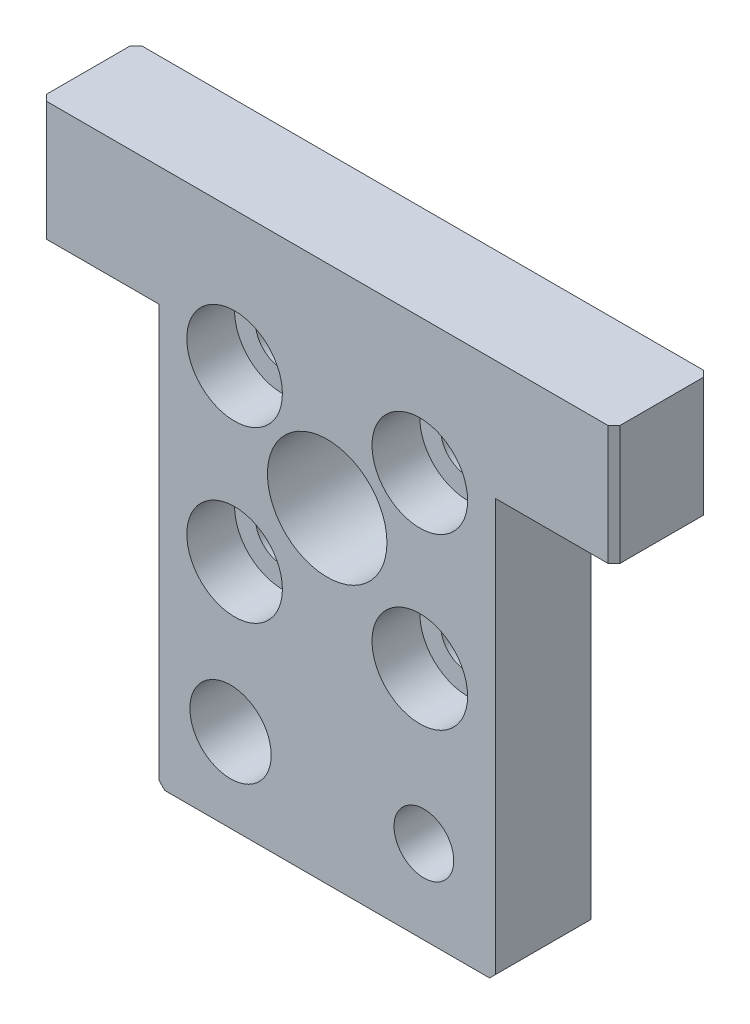
ISO-10303-21;
HEADER;
FILE_DESCRIPTION(('STEP AP214'),'2;1');
FILE_NAME('part.step','',(''),(''),'','','');
FILE_SCHEMA(('AUTOMOTIVE_DESIGN { 1 0 10303 214 1 1 1 1 }'));
ENDSEC;
DATA;
#1=APPLICATION_CONTEXT('core data for automotive mechanical design processes');
#2=APPLICATION_PROTOCOL_DEFINITION('international standard','automotive_design',2000,#1);
#3=PRODUCT_CONTEXT('',#1,'mechanical');
#4=PRODUCT('Part','Part','',(#3));
#5=PRODUCT_RELATED_PRODUCT_CATEGORY('part','',(#4));
#6=PRODUCT_DEFINITION_FORMATION('','',#4);
#7=PRODUCT_DEFINITION_CONTEXT('part definition',#1,'design');
#8=PRODUCT_DEFINITION('design','',#6,#7);
#9=PRODUCT_DEFINITION_SHAPE('','',#8);
#10=(LENGTH_UNIT() NAMED_UNIT(*) SI_UNIT(.MILLI.,.METRE.));
#11=(NAMED_UNIT(*) PLANE_ANGLE_UNIT() SI_UNIT($,.RADIAN.));
#12=(NAMED_UNIT(*) SI_UNIT($,.STERADIAN.) SOLID_ANGLE_UNIT());
#13=UNCERTAINTY_MEASURE_WITH_UNIT(LENGTH_MEASURE(1.E-05),#10,'distance_accuracy_value','');
#14=(GEOMETRIC_REPRESENTATION_CONTEXT(3) GLOBAL_UNCERTAINTY_ASSIGNED_CONTEXT((#13)) GLOBAL_UNIT_ASSIGNED_CONTEXT((#10,
#11,#12)) REPRESENTATION_CONTEXT('',''));
#15=CARTESIAN_POINT('',(0.,0.,0.));
#16=DIRECTION('',(0.,0.,1.));
#17=DIRECTION('',(1.,0.,0.));
#18=AXIS2_PLACEMENT_3D('',#15,#16,#17);
#19=CARTESIAN_POINT('',(-0.585820895522372,-3.85820895522388,8.));
#20=DIRECTION('',(0.,0.,-1.));
#21=DIRECTION('',(-1.,0.,0.));
#22=AXIS2_PLACEMENT_3D('',#19,#20,#21);
#23=CYLINDRICAL_SURFACE('',#22,2.25);
#24=CARTESIAN_POINT('',(-0.585820895522372,-3.85820895522388,0.));
#25=DIRECTION('',(0.,0.,1.));
#26=DIRECTION('',(1.,0.,0.));
#27=AXIS2_PLACEMENT_3D('',#24,#25,#26);
#28=CIRCLE('',#27,2.25);
#29=CARTESIAN_POINT('',(1.66417910447763,-3.85820895522388,0.));
#30=VERTEX_POINT('',#29);
#31=EDGE_CURVE('E452',#30,#30,#28,.T.);
#32=ORIENTED_EDGE('',*,*,#31,.F.);
#33=EDGE_LOOP('',(#32));
#34=FACE_BOUND('',#33,.T.);
#35=CARTESIAN_POINT('',(-0.585820895522372,-3.85820895522388,4.));
#36=DIRECTION('',(0.,0.,1.));
#37=DIRECTION('',(1.,0.,0.));
#38=AXIS2_PLACEMENT_3D('',#35,#36,#37);
#39=CIRCLE('',#38,2.25);
#40=CARTESIAN_POINT('',(1.66417910447763,-3.85820895522388,4.));
#41=VERTEX_POINT('',#40);
#42=EDGE_CURVE('E211',#41,#41,#39,.T.);
#43=ORIENTED_EDGE('',*,*,#42,.T.);
#44=EDGE_LOOP('',(#43));
#45=FACE_BOUND('',#44,.T.);
#46=ADVANCED_FACE('F35',(#34,#45),#23,.F.);
#47=CARTESIAN_POINT('',(14.9141791044776,-3.85820895522388,8.));
#48=DIRECTION('',(0.,0.,-1.));
#49=DIRECTION('',(-1.,0.,0.));
#50=AXIS2_PLACEMENT_3D('',#47,#48,#49);
#51=CYLINDRICAL_SURFACE('',#50,2.25);
#52=CARTESIAN_POINT('',(14.9141791044776,-3.85820895522388,0.));
#53=DIRECTION('',(0.,0.,1.));
#54=DIRECTION('',(1.,0.,0.));
#55=AXIS2_PLACEMENT_3D('',#52,#53,#54);
#56=CIRCLE('',#55,2.25);
#57=CARTESIAN_POINT('',(17.1641791044776,-3.85820895522388,0.));
#58=VERTEX_POINT('',#57);
#59=EDGE_CURVE('E449',#58,#58,#56,.T.);
#60=ORIENTED_EDGE('',*,*,#59,.F.);
#61=EDGE_LOOP('',(#60));
#62=FACE_BOUND('',#61,.T.);
#63=CARTESIAN_POINT('',(14.9141791044776,-3.85820895522388,4.));
#64=DIRECTION('',(0.,0.,1.));
#65=DIRECTION('',(1.,0.,0.));
#66=AXIS2_PLACEMENT_3D('',#63,#64,#65);
#67=CIRCLE('',#66,2.25);
#68=CARTESIAN_POINT('',(17.1641791044776,-3.85820895522388,4.));
#69=VERTEX_POINT('',#68);
#70=EDGE_CURVE('E207',#69,#69,#67,.T.);
#71=ORIENTED_EDGE('',*,*,#70,.T.);
#72=EDGE_LOOP('',(#71));
#73=FACE_BOUND('',#72,.T.);
#74=ADVANCED_FACE('F320',(#62,#73),#51,.F.);
#75=CARTESIAN_POINT('',(14.9141791044776,10.3283582089552,8.));
#76=DIRECTION('',(0.,0.,-1.));
#77=DIRECTION('',(-1.,0.,0.));
#78=AXIS2_PLACEMENT_3D('',#75,#76,#77);
#79=CYLINDRICAL_SURFACE('',#78,2.25);
#80=CARTESIAN_POINT('',(14.9141791044776,10.3283582089552,0.));
#81=DIRECTION('',(0.,0.,1.));
#82=DIRECTION('',(1.,0.,0.));
#83=AXIS2_PLACEMENT_3D('',#80,#81,#82);
#84=CIRCLE('',#83,2.25);
#85=CARTESIAN_POINT('',(17.1641791044776,10.3283582089552,0.));
#86=VERTEX_POINT('',#85);
#87=EDGE_CURVE('E417',#86,#86,#84,.T.);
#88=ORIENTED_EDGE('',*,*,#87,.F.);
#89=EDGE_LOOP('',(#88));
#90=FACE_BOUND('',#89,.T.);
#91=CARTESIAN_POINT('',(14.9141791044776,10.3283582089552,4.));
#92=DIRECTION('',(0.,0.,1.));
#93=DIRECTION('',(1.,0.,0.));
#94=AXIS2_PLACEMENT_3D('',#91,#92,#93);
#95=CIRCLE('',#94,2.25);
#96=CARTESIAN_POINT('',(17.1641791044776,10.3283582089552,4.));
#97=VERTEX_POINT('',#96);
#98=EDGE_CURVE('E204',#97,#97,#95,.T.);
#99=ORIENTED_EDGE('',*,*,#98,.T.);
#100=EDGE_LOOP('',(#99));
#101=FACE_BOUND('',#100,.T.);
#102=ADVANCED_FACE('F326',(#90,#101),#79,.F.);
#103=CARTESIAN_POINT('',(-0.585820895522371,10.3283582089552,8.));
#104=DIRECTION('',(0.,0.,-1.));
#105=DIRECTION('',(-1.,0.,0.));
#106=AXIS2_PLACEMENT_3D('',#103,#104,#105);
#107=CYLINDRICAL_SURFACE('',#106,2.25);
#108=CARTESIAN_POINT('',(-0.585820895522371,10.3283582089552,0.));
#109=DIRECTION('',(0.,0.,1.));
#110=DIRECTION('',(1.,0.,0.));
#111=AXIS2_PLACEMENT_3D('',#108,#109,#110);
#112=CIRCLE('',#111,2.25);
#113=CARTESIAN_POINT('',(1.66417910447763,10.3283582089552,0.));
#114=VERTEX_POINT('',#113);
#115=EDGE_CURVE('E202',#114,#114,#112,.T.);
#116=ORIENTED_EDGE('',*,*,#115,.F.);
#117=EDGE_LOOP('',(#116));
#118=FACE_BOUND('',#117,.T.);
#119=CARTESIAN_POINT('',(-0.585820895522371,10.3283582089552,4.));
#120=DIRECTION('',(0.,0.,1.));
#121=DIRECTION('',(1.,0.,0.));
#122=AXIS2_PLACEMENT_3D('',#119,#120,#121);
#123=CIRCLE('',#122,2.25);
#124=CARTESIAN_POINT('',(1.66417910447763,10.3283582089552,4.));
#125=VERTEX_POINT('',#124);
#126=EDGE_CURVE('E199',#125,#125,#123,.T.);
#127=ORIENTED_EDGE('',*,*,#126,.T.);
#128=EDGE_LOOP('',(#127));
#129=FACE_BOUND('',#128,.T.);
#130=ADVANCED_FACE('F340',(#118,#129),#107,.F.);
#131=CARTESIAN_POINT('',(0.,0.,8.));
#132=DIRECTION('',(0.,0.,1.));
#133=DIRECTION('',(1.,0.,0.));
#134=AXIS2_PLACEMENT_3D('',#131,#132,#133);
#135=PLANE('',#134);
#136=CARTESIAN_POINT('',(-0.925373134328333,-16.3582089552239,8.));
#137=DIRECTION('',(0.,0.,1.));
#138=DIRECTION('',(1.,0.,0.));
#139=AXIS2_PLACEMENT_3D('',#136,#137,#138);
#140=CIRCLE('',#139,3.4);
#141=CARTESIAN_POINT('',(2.47462686567166,-16.3582089552239,8.));
#142=VERTEX_POINT('',#141);
#143=EDGE_CURVE('E492',#142,#142,#140,.T.);
#144=ORIENTED_EDGE('',*,*,#143,.F.);
#145=EDGE_LOOP('',(#144));
#146=FACE_BOUND('',#145,.T.);
#147=CARTESIAN_POINT('',(15.2537313432836,-16.3582089552239,8.));
#148=DIRECTION('',(0.,0.,1.));
#149=DIRECTION('',(1.,0.,0.));
#150=AXIS2_PLACEMENT_3D('',#147,#148,#149);
#151=CIRCLE('',#150,2.5);
#152=CARTESIAN_POINT('',(17.7537313432836,-16.3582089552239,8.));
#153=VERTEX_POINT('',#152);
#154=EDGE_CURVE('E485',#153,#153,#151,.T.);
#155=ORIENTED_EDGE('',*,*,#154,.F.);
#156=EDGE_LOOP('',(#155));
#157=FACE_BOUND('',#156,.T.);
#158=CARTESIAN_POINT('',(14.9141791044776,10.3283582089552,8.));
#159=DIRECTION('',(0.,0.,1.));
#160=DIRECTION('',(1.,0.,0.));
#161=AXIS2_PLACEMENT_3D('',#158,#159,#160);
#162=CIRCLE('',#161,4.);
#163=CARTESIAN_POINT('',(18.9141791044776,10.3283582089552,8.));
#164=VERTEX_POINT('',#163);
#165=EDGE_CURVE('E422',#164,#164,#162,.T.);
#166=ORIENTED_EDGE('',*,*,#165,.F.);
#167=EDGE_LOOP('',(#166));
#168=FACE_BOUND('',#167,.T.);
#169=CARTESIAN_POINT('',(14.9141791044776,-3.85820895522388,8.));
#170=DIRECTION('',(0.,0.,1.));
#171=DIRECTION('',(1.,0.,0.));
#172=AXIS2_PLACEMENT_3D('',#169,#170,#171);
#173=CIRCLE('',#172,4.);
#174=CARTESIAN_POINT('',(18.9141791044776,-3.85820895522388,8.));
#175=VERTEX_POINT('',#174);
#176=EDGE_CURVE('E433',#175,#175,#173,.T.);
#177=ORIENTED_EDGE('',*,*,#176,.F.);
#178=EDGE_LOOP('',(#177));
#179=FACE_BOUND('',#178,.T.);
#180=CARTESIAN_POINT('',(-0.585820895522372,-3.85820895522388,8.));
#181=DIRECTION('',(0.,0.,1.));
#182=DIRECTION('',(1.,0.,0.));
#183=AXIS2_PLACEMENT_3D('',#180,#181,#182);
#184=CIRCLE('',#183,4.);
#185=CARTESIAN_POINT('',(3.41417910447763,-3.85820895522388,8.));
#186=VERTEX_POINT('',#185);
#187=EDGE_CURVE('E439',#186,#186,#184,.T.);
#188=ORIENTED_EDGE('',*,*,#187,.F.);
#189=EDGE_LOOP('',(#188));
#190=FACE_BOUND('',#189,.T.);
#191=CARTESIAN_POINT('',(-0.585820895522371,10.3283582089552,8.));
#192=DIRECTION('',(0.,0.,1.));
#193=DIRECTION('',(1.,0.,0.));
#194=AXIS2_PLACEMENT_3D('',#191,#192,#193);
#195=CIRCLE('',#194,4.);
#196=CARTESIAN_POINT('',(3.41417910447763,10.3283582089552,8.));
#197=VERTEX_POINT('',#196);
#198=EDGE_CURVE('E214',#197,#197,#195,.T.);
#199=ORIENTED_EDGE('',*,*,#198,.F.);
#200=EDGE_LOOP('',(#199));
#201=FACE_BOUND('',#200,.T.);
#202=DIRECTION('',(0.,-1.,0.));
#203=VECTOR('',#202,1.);
#204=CARTESIAN_POINT('',(-6.92537313432833,11.6417910447761,8.));
#205=LINE('',#204,#203);
#206=CARTESIAN_POINT('',(-6.92537313432833,11.6417910447761,8.));
#207=VERTEX_POINT('',#206);
#208=CARTESIAN_POINT('',(-6.92537313432833,-22.8582089552239,8.));
#209=VERTEX_POINT('',#208);
#210=EDGE_CURVE('E142',#207,#209,#205,.T.);
#211=ORIENTED_EDGE('',*,*,#210,.T.);
#212=DIRECTION('',(-0.707106781186544,0.707106781186551,0.));
#213=VECTOR('',#212,1.);
#214=CARTESIAN_POINT('',(-14.8917910447761,-14.891791044776,8.));
#215=LINE('',#214,#213);
#216=CARTESIAN_POINT('',(-6.42537313432833,-23.3582089552239,8.));
#217=VERTEX_POINT('',#216);
#218=EDGE_CURVE('E43',#209,#217,#215,.F.);
#219=ORIENTED_EDGE('',*,*,#218,.T.);
#220=DIRECTION('',(1.,0.,0.));
#221=VECTOR('',#220,1.);
#222=CARTESIAN_POINT('',(21.2537313432836,-23.3582089552239,8.));
#223=LINE('',#222,#221);
#224=CARTESIAN_POINT('',(20.7537313432836,-23.3582089552239,8.));
#225=VERTEX_POINT('',#224);
#226=EDGE_CURVE('E161',#217,#225,#223,.T.);
#227=ORIENTED_EDGE('',*,*,#226,.T.);
#228=DIRECTION('',(-0.707106781186548,-0.707106781186548,0.));
#229=VECTOR('',#228,1.);
#230=CARTESIAN_POINT('',(22.0559701492537,-22.0559701492537,8.));
#231=LINE('',#230,#229);
#232=CARTESIAN_POINT('',(21.2537313432836,-22.8582089552239,8.));
#233=VERTEX_POINT('',#232);
#234=EDGE_CURVE('E50',#225,#233,#231,.F.);
#235=ORIENTED_EDGE('',*,*,#234,.T.);
#236=DIRECTION('',(0.,1.,0.));
#237=VECTOR('',#236,1.);
#238=CARTESIAN_POINT('',(21.2537313432836,11.6417910447761,8.));
#239=LINE('',#238,#237);
#240=CARTESIAN_POINT('',(21.2537313432836,11.6417910447761,8.));
#241=VERTEX_POINT('',#240);
#242=EDGE_CURVE('E163',#233,#241,#239,.T.);
#243=ORIENTED_EDGE('',*,*,#242,.T.);
#244=DIRECTION('',(1.,0.,0.));
#245=VECTOR('',#244,1.);
#246=CARTESIAN_POINT('',(21.2537313432836,11.6417910447761,8.));
#247=LINE('',#246,#245);
#248=CARTESIAN_POINT('',(30.6641791044776,11.6417910447761,8.));
#249=VERTEX_POINT('',#248);
#250=EDGE_CURVE('E168',#241,#249,#247,.T.);
#251=ORIENTED_EDGE('',*,*,#250,.T.);
#252=DIRECTION('',(0.,1.,0.));
#253=VECTOR('',#252,1.);
#254=CARTESIAN_POINT('',(30.6641791044776,21.6417910447761,8.));
#255=LINE('',#254,#253);
#256=CARTESIAN_POINT('',(30.6641791044776,21.6417910447761,8.));
#257=VERTEX_POINT('',#256);
#258=EDGE_CURVE('E216',#249,#257,#255,.T.);
#259=ORIENTED_EDGE('',*,*,#258,.T.);
#260=DIRECTION('',(-1.,0.,0.));
#261=VECTOR('',#260,1.);
#262=CARTESIAN_POINT('',(-16.8358208955224,21.6417910447761,8.));
#263=LINE('',#262,#261);
#264=CARTESIAN_POINT('',(-16.3358208955224,21.6417910447761,8.));
#265=VERTEX_POINT('',#264);
#266=EDGE_CURVE('E171',#257,#265,#263,.T.);
#267=ORIENTED_EDGE('',*,*,#266,.T.);
#268=DIRECTION('',(0.,-1.,0.));
#269=VECTOR('',#268,1.);
#270=CARTESIAN_POINT('',(-16.3358208955224,11.6417910447761,8.));
#271=LINE('',#270,#269);
#272=CARTESIAN_POINT('',(-16.3358208955224,11.6417910447761,8.));
#273=VERTEX_POINT('',#272);
#274=EDGE_CURVE('E146',#265,#273,#271,.T.);
#275=ORIENTED_EDGE('',*,*,#274,.T.);
#276=DIRECTION('',(1.,0.,0.));
#277=VECTOR('',#276,1.);
#278=CARTESIAN_POINT('',(-16.8358208955224,11.6417910447761,8.));
#279=LINE('',#278,#277);
#280=EDGE_CURVE('E138',#273,#207,#279,.T.);
#281=ORIENTED_EDGE('',*,*,#280,.T.);
#282=EDGE_LOOP('',(#211,#219,#227,#235,#243,#251,#259,#267,#275,#281));
#283=FACE_BOUND('',#282,.T.);
#284=CARTESIAN_POINT('',(7.16417910447763,3.89179104477612,8.));
#285=DIRECTION('',(0.,0.,1.));
#286=DIRECTION('',(1.,0.,0.));
#287=AXIS2_PLACEMENT_3D('',#284,#285,#286);
#288=CIRCLE('',#287,5.);
#289=CARTESIAN_POINT('',(12.1641791044776,3.89179104477612,8.));
#290=VERTEX_POINT('',#289);
#291=EDGE_CURVE('E176',#290,#290,#288,.T.);
#292=ORIENTED_EDGE('',*,*,#291,.F.);
#293=EDGE_LOOP('',(#292));
#294=FACE_BOUND('',#293,.T.);
#295=ADVANCED_FACE('F140',(#146,#157,#168,#179,#190,#201,#283,#294),#135,.T.);
#296=CARTESIAN_POINT('',(0.,0.,0.));
#297=DIRECTION('',(0.,0.,1.));
#298=DIRECTION('',(1.,0.,0.));
#299=AXIS2_PLACEMENT_3D('',#296,#297,#298);
#300=PLANE('',#299);
#301=CARTESIAN_POINT('',(-0.925373134328333,-16.3582089552239,0.));
#302=DIRECTION('',(0.,0.,1.));
#303=DIRECTION('',(1.,0.,0.));
#304=AXIS2_PLACEMENT_3D('',#301,#302,#303);
#305=CIRCLE('',#304,3.4);
#306=CARTESIAN_POINT('',(2.47462686567166,-16.3582089552239,0.));
#307=VERTEX_POINT('',#306);
#308=EDGE_CURVE('E489',#307,#307,#305,.T.);
#309=ORIENTED_EDGE('',*,*,#308,.T.);
#310=EDGE_LOOP('',(#309));
#311=FACE_BOUND('',#310,.T.);
#312=CARTESIAN_POINT('',(15.2537313432836,-16.3582089552239,0.));
#313=DIRECTION('',(0.,0.,1.));
#314=DIRECTION('',(1.,0.,0.));
#315=AXIS2_PLACEMENT_3D('',#312,#313,#314);
#316=CIRCLE('',#315,2.5);
#317=CARTESIAN_POINT('',(17.7537313432836,-16.3582089552239,0.));
#318=VERTEX_POINT('',#317);
#319=EDGE_CURVE('E428',#318,#318,#316,.T.);
#320=ORIENTED_EDGE('',*,*,#319,.T.);
#321=EDGE_LOOP('',(#320));
#322=FACE_BOUND('',#321,.T.);
#323=DIRECTION('',(1.,0.,0.));
#324=VECTOR('',#323,1.);
#325=CARTESIAN_POINT('',(21.2537313432836,-23.3582089552239,0.));
#326=LINE('',#325,#324);
#327=CARTESIAN_POINT('',(-6.42537313432833,-23.3582089552239,0.));
#328=VERTEX_POINT('',#327);
#329=CARTESIAN_POINT('',(20.7537313432836,-23.3582089552239,0.));
#330=VERTEX_POINT('',#329);
#331=EDGE_CURVE('E178',#328,#330,#326,.T.);
#332=ORIENTED_EDGE('',*,*,#331,.F.);
#333=DIRECTION('',(0.707106781186544,-0.707106781186551,0.));
#334=VECTOR('',#333,1.);
#335=CARTESIAN_POINT('',(-6.42537313432833,-23.3582089552239,0.));
#336=LINE('',#335,#334);
#337=CARTESIAN_POINT('',(-6.92537313432833,-22.8582089552239,0.));
#338=VERTEX_POINT('',#337);
#339=EDGE_CURVE('E256',#328,#338,#336,.F.);
#340=ORIENTED_EDGE('',*,*,#339,.T.);
#341=DIRECTION('',(0.,-1.,0.));
#342=VECTOR('',#341,1.);
#343=CARTESIAN_POINT('',(-6.92537313432833,11.6417910447761,0.));
#344=LINE('',#343,#342);
#345=CARTESIAN_POINT('',(-6.92537313432833,11.6417910447761,0.));
#346=VERTEX_POINT('',#345);
#347=EDGE_CURVE('E175',#346,#338,#344,.T.);
#348=ORIENTED_EDGE('',*,*,#347,.F.);
#349=DIRECTION('',(1.,0.,0.));
#350=VECTOR('',#349,1.);
#351=CARTESIAN_POINT('',(-16.8358208955224,11.6417910447761,0.));
#352=LINE('',#351,#350);
#353=CARTESIAN_POINT('',(-16.3358208955224,11.6417910447761,0.));
#354=VERTEX_POINT('',#353);
#355=EDGE_CURVE('E155',#354,#346,#352,.T.);
#356=ORIENTED_EDGE('',*,*,#355,.F.);
#357=DIRECTION('',(0.,1.,0.));
#358=VECTOR('',#357,1.);
#359=CARTESIAN_POINT('',(-16.3358208955224,0.,0.));
#360=LINE('',#359,#358);
#361=CARTESIAN_POINT('',(-16.3358208955224,21.6417910447761,0.));
#362=VERTEX_POINT('',#361);
#363=EDGE_CURVE('E236',#354,#362,#360,.T.);
#364=ORIENTED_EDGE('',*,*,#363,.T.);
#365=DIRECTION('',(-1.,0.,0.));
#366=VECTOR('',#365,1.);
#367=CARTESIAN_POINT('',(-16.8358208955224,21.6417910447761,0.));
#368=LINE('',#367,#366);
#369=CARTESIAN_POINT('',(30.6641791044776,21.6417910447761,0.));
#370=VERTEX_POINT('',#369);
#371=EDGE_CURVE('E148',#370,#362,#368,.T.);
#372=ORIENTED_EDGE('',*,*,#371,.F.);
#373=DIRECTION('',(0.,-1.,0.));
#374=VECTOR('',#373,1.);
#375=CARTESIAN_POINT('',(30.6641791044776,0.,0.));
#376=LINE('',#375,#374);
#377=CARTESIAN_POINT('',(30.6641791044776,11.6417910447761,0.));
#378=VERTEX_POINT('',#377);
#379=EDGE_CURVE('E238',#370,#378,#376,.T.);
#380=ORIENTED_EDGE('',*,*,#379,.T.);
#381=DIRECTION('',(1.,0.,0.));
#382=VECTOR('',#381,1.);
#383=CARTESIAN_POINT('',(21.2537313432836,11.6417910447761,0.));
#384=LINE('',#383,#382);
#385=CARTESIAN_POINT('',(21.2537313432836,11.6417910447761,0.));
#386=VERTEX_POINT('',#385);
#387=EDGE_CURVE('E183',#386,#378,#384,.T.);
#388=ORIENTED_EDGE('',*,*,#387,.F.);
#389=DIRECTION('',(0.,1.,0.));
#390=VECTOR('',#389,1.);
#391=CARTESIAN_POINT('',(21.2537313432836,11.6417910447761,0.));
#392=LINE('',#391,#390);
#393=CARTESIAN_POINT('',(21.2537313432836,-22.8582089552239,0.));
#394=VERTEX_POINT('',#393);
#395=EDGE_CURVE('E181',#394,#386,#392,.T.);
#396=ORIENTED_EDGE('',*,*,#395,.F.);
#397=DIRECTION('',(0.707106781186548,0.707106781186548,0.));
#398=VECTOR('',#397,1.);
#399=CARTESIAN_POINT('',(21.2537313432836,-22.8582089552239,0.));
#400=LINE('',#399,#398);
#401=EDGE_CURVE('E254',#394,#330,#400,.F.);
#402=ORIENTED_EDGE('',*,*,#401,.T.);
#403=EDGE_LOOP('',(#332,#340,#348,#356,#364,#372,#380,#388,#396,#402));
#404=FACE_BOUND('',#403,.T.);
#405=CARTESIAN_POINT('',(7.16417910447763,3.89179104477612,0.));
#406=DIRECTION('',(0.,0.,1.));
#407=DIRECTION('',(1.,0.,0.));
#408=AXIS2_PLACEMENT_3D('',#405,#406,#407);
#409=CIRCLE('',#408,5.);
#410=CARTESIAN_POINT('',(12.1641791044776,3.89179104477612,0.));
#411=VERTEX_POINT('',#410);
#412=EDGE_CURVE('E455',#411,#411,#409,.T.);
#413=ORIENTED_EDGE('',*,*,#412,.T.);
#414=EDGE_LOOP('',(#413));
#415=FACE_BOUND('',#414,.T.);
#416=ORIENTED_EDGE('',*,*,#31,.T.);
#417=EDGE_LOOP('',(#416));
#418=FACE_BOUND('',#417,.T.);
#419=ORIENTED_EDGE('',*,*,#59,.T.);
#420=EDGE_LOOP('',(#419));
#421=FACE_BOUND('',#420,.T.);
#422=ORIENTED_EDGE('',*,*,#87,.T.);
#423=EDGE_LOOP('',(#422));
#424=FACE_BOUND('',#423,.T.);
#425=ORIENTED_EDGE('',*,*,#115,.T.);
#426=EDGE_LOOP('',(#425));
#427=FACE_BOUND('',#426,.T.);
#428=ADVANCED_FACE('F268',(#311,#322,#404,#415,#418,#421,#424,#427),#300,.F.);
#429=CARTESIAN_POINT('',(-16.8358208955224,21.6417910447761,8.));
#430=DIRECTION('',(1.,0.,0.));
#431=DIRECTION('',(0.,0.,-1.));
#432=AXIS2_PLACEMENT_3D('',#429,#430,#431);
#433=PLANE('',#432);
#434=DIRECTION('',(0.,0.,-1.));
#435=VECTOR('',#434,1.);
#436=CARTESIAN_POINT('',(-16.8358208955224,21.6417910447761,8.));
#437=LINE('',#436,#435);
#438=CARTESIAN_POINT('',(-16.8358208955224,21.6417910447761,7.49999999999999));
#439=VERTEX_POINT('',#438);
#440=CARTESIAN_POINT('',(-16.8358208955224,21.6417910447761,0.5));
#441=VERTEX_POINT('',#440);
#442=EDGE_CURVE('E173',#439,#441,#437,.T.);
#443=ORIENTED_EDGE('',*,*,#442,.T.);
#444=DIRECTION('',(0.,-1.,0.));
#445=VECTOR('',#444,1.);
#446=CARTESIAN_POINT('',(-16.8358208955224,21.6417910447761,0.5));
#447=LINE('',#446,#445);
#448=CARTESIAN_POINT('',(-16.8358208955224,11.6417910447761,0.5));
#449=VERTEX_POINT('',#448);
#450=EDGE_CURVE('E242',#441,#449,#447,.T.);
#451=ORIENTED_EDGE('',*,*,#450,.T.);
#452=DIRECTION('',(0.,0.,-1.));
#453=VECTOR('',#452,1.);
#454=CARTESIAN_POINT('',(-16.8358208955224,11.6417910447761,8.));
#455=LINE('',#454,#453);
#456=CARTESIAN_POINT('',(-16.8358208955224,11.6417910447761,7.49999999999999));
#457=VERTEX_POINT('',#456);
#458=EDGE_CURVE('E157',#457,#449,#455,.T.);
#459=ORIENTED_EDGE('',*,*,#458,.F.);
#460=DIRECTION('',(0.,1.,0.));
#461=VECTOR('',#460,1.);
#462=CARTESIAN_POINT('',(-16.8358208955224,21.6417910447761,7.49999999999999));
#463=LINE('',#462,#461);
#464=EDGE_CURVE('E240',#457,#439,#463,.T.);
#465=ORIENTED_EDGE('',*,*,#464,.T.);
#466=EDGE_LOOP('',(#443,#451,#459,#465));
#467=FACE_BOUND('',#466,.T.);
#468=ADVANCED_FACE('F304',(#467),#433,.F.);
#469=CARTESIAN_POINT('',(-16.8358208955224,11.6417910447761,8.));
#470=DIRECTION('',(0.,1.,0.));
#471=DIRECTION('',(0.,0.,1.));
#472=AXIS2_PLACEMENT_3D('',#469,#470,#471);
#473=PLANE('',#472);
#474=ORIENTED_EDGE('',*,*,#458,.T.);
#475=DIRECTION('',(-0.707106781186548,0.,0.707106781186548));
#476=VECTOR('',#475,1.);
#477=CARTESIAN_POINT('',(-16.8358208955224,11.6417910447761,0.5));
#478=LINE('',#477,#476);
#479=EDGE_CURVE('E247',#449,#354,#478,.F.);
#480=ORIENTED_EDGE('',*,*,#479,.T.);
#481=ORIENTED_EDGE('',*,*,#355,.T.);
#482=DIRECTION('',(0.,0.,-1.));
#483=VECTOR('',#482,1.);
#484=CARTESIAN_POINT('',(-6.92537313432833,11.6417910447761,8.));
#485=LINE('',#484,#483);
#486=EDGE_CURVE('E151',#207,#346,#485,.T.);
#487=ORIENTED_EDGE('',*,*,#486,.F.);
#488=ORIENTED_EDGE('',*,*,#280,.F.);
#489=DIRECTION('',(-0.707106781186543,0.,-0.707106781186552));
#490=VECTOR('',#489,1.);
#491=CARTESIAN_POINT('',(-16.3358208955224,11.6417910447761,8.));
#492=LINE('',#491,#490);
#493=EDGE_CURVE('E245',#273,#457,#492,.T.);
#494=ORIENTED_EDGE('',*,*,#493,.T.);
#495=EDGE_LOOP('',(#474,#480,#481,#487,#488,#494));
#496=FACE_BOUND('',#495,.T.);
#497=ADVANCED_FACE('F153',(#496),#473,.F.);
#498=CARTESIAN_POINT('',(-6.92537313432833,11.6417910447761,8.));
#499=DIRECTION('',(1.,0.,0.));
#500=DIRECTION('',(0.,0.,-1.));
#501=AXIS2_PLACEMENT_3D('',#498,#499,#500);
#502=PLANE('',#501);
#503=ORIENTED_EDGE('',*,*,#347,.T.);
#504=DIRECTION('',(0.,0.,1.));
#505=VECTOR('',#504,1.);
#506=CARTESIAN_POINT('',(-6.92537313432833,-22.8582089552239,8.));
#507=LINE('',#506,#505);
#508=EDGE_CURVE('E58',#338,#209,#507,.T.);
#509=ORIENTED_EDGE('',*,*,#508,.T.);
#510=ORIENTED_EDGE('',*,*,#210,.F.);
#511=ORIENTED_EDGE('',*,*,#486,.T.);
#512=EDGE_LOOP('',(#503,#509,#510,#511));
#513=FACE_BOUND('',#512,.T.);
#514=ADVANCED_FACE('F160',(#513),#502,.F.);
#515=CARTESIAN_POINT('',(21.2537313432836,-23.3582089552239,8.));
#516=DIRECTION('',(0.,1.,0.));
#517=DIRECTION('',(-1.,0.,0.));
#518=AXIS2_PLACEMENT_3D('',#515,#516,#517);
#519=PLANE('',#518);
#520=ORIENTED_EDGE('',*,*,#226,.F.);
#521=DIRECTION('',(0.,0.,-1.));
#522=VECTOR('',#521,1.);
#523=CARTESIAN_POINT('',(-6.42537313432833,-23.3582089552239,8.));
#524=LINE('',#523,#522);
#525=EDGE_CURVE('E251',#217,#328,#524,.T.);
#526=ORIENTED_EDGE('',*,*,#525,.T.);
#527=ORIENTED_EDGE('',*,*,#331,.T.);
#528=DIRECTION('',(0.,0.,1.));
#529=VECTOR('',#528,1.);
#530=CARTESIAN_POINT('',(20.7537313432836,-23.3582089552239,8.));
#531=LINE('',#530,#529);
#532=EDGE_CURVE('E249',#330,#225,#531,.T.);
#533=ORIENTED_EDGE('',*,*,#532,.T.);
#534=EDGE_LOOP('',(#520,#526,#527,#533));
#535=FACE_BOUND('',#534,.T.);
#536=ADVANCED_FACE('F263',(#535),#519,.F.);
#537=CARTESIAN_POINT('',(21.2537313432836,11.6417910447761,8.));
#538=DIRECTION('',(-1.,0.,0.));
#539=DIRECTION('',(0.,-1.,0.));
#540=AXIS2_PLACEMENT_3D('',#537,#538,#539);
#541=PLANE('',#540);
#542=ORIENTED_EDGE('',*,*,#242,.F.);
#543=DIRECTION('',(0.,0.,-1.));
#544=VECTOR('',#543,1.);
#545=CARTESIAN_POINT('',(21.2537313432836,-22.8582089552239,8.));
#546=LINE('',#545,#544);
#547=EDGE_CURVE('E11',#233,#394,#546,.T.);
#548=ORIENTED_EDGE('',*,*,#547,.T.);
#549=ORIENTED_EDGE('',*,*,#395,.T.);
#550=DIRECTION('',(0.,0.,-1.));
#551=VECTOR('',#550,1.);
#552=CARTESIAN_POINT('',(21.2537313432836,11.6417910447761,8.));
#553=LINE('',#552,#551);
#554=EDGE_CURVE('E158',#241,#386,#553,.T.);
#555=ORIENTED_EDGE('',*,*,#554,.F.);
#556=EDGE_LOOP('',(#542,#548,#549,#555));
#557=FACE_BOUND('',#556,.T.);
#558=ADVANCED_FACE('F274',(#557),#541,.F.);
#559=CARTESIAN_POINT('',(21.2537313432836,11.6417910447761,8.));
#560=DIRECTION('',(0.,1.,0.));
#561=DIRECTION('',(0.,0.,1.));
#562=AXIS2_PLACEMENT_3D('',#559,#560,#561);
#563=PLANE('',#562);
#564=DIRECTION('',(0.,0.,-1.));
#565=VECTOR('',#564,1.);
#566=CARTESIAN_POINT('',(31.1641791044776,11.6417910447761,8.));
#567=LINE('',#566,#565);
#568=CARTESIAN_POINT('',(31.1641791044776,11.6417910447761,7.49999999999999));
#569=VERTEX_POINT('',#568);
#570=CARTESIAN_POINT('',(31.1641791044776,11.6417910447761,0.5));
#571=VERTEX_POINT('',#570);
#572=EDGE_CURVE('E193',#569,#571,#567,.T.);
#573=ORIENTED_EDGE('',*,*,#572,.F.);
#574=DIRECTION('',(-0.707106781186543,0.,0.707106781186552));
#575=VECTOR('',#574,1.);
#576=CARTESIAN_POINT('',(30.6641791044776,11.6417910447761,8.));
#577=LINE('',#576,#575);
#578=EDGE_CURVE('E234',#569,#249,#577,.T.);
#579=ORIENTED_EDGE('',*,*,#578,.T.);
#580=ORIENTED_EDGE('',*,*,#250,.F.);
#581=ORIENTED_EDGE('',*,*,#554,.T.);
#582=ORIENTED_EDGE('',*,*,#387,.T.);
#583=DIRECTION('',(-0.707106781186548,0.,-0.707106781186548));
#584=VECTOR('',#583,1.);
#585=CARTESIAN_POINT('',(31.1641791044776,11.6417910447761,0.5));
#586=LINE('',#585,#584);
#587=EDGE_CURVE('E232',#378,#571,#586,.F.);
#588=ORIENTED_EDGE('',*,*,#587,.T.);
#589=EDGE_LOOP('',(#573,#579,#580,#581,#582,#588));
#590=FACE_BOUND('',#589,.T.);
#591=ADVANCED_FACE('F282',(#590),#563,.F.);
#592=CARTESIAN_POINT('',(31.1641791044776,21.6417910447761,8.));
#593=DIRECTION('',(-1.,0.,0.));
#594=DIRECTION('',(0.,0.,1.));
#595=AXIS2_PLACEMENT_3D('',#592,#593,#594);
#596=PLANE('',#595);
#597=DIRECTION('',(0.,0.,-1.));
#598=VECTOR('',#597,1.);
#599=CARTESIAN_POINT('',(31.1641791044776,21.6417910447761,8.));
#600=LINE('',#599,#598);
#601=CARTESIAN_POINT('',(31.1641791044776,21.6417910447761,7.49999999999999));
#602=VERTEX_POINT('',#601);
#603=CARTESIAN_POINT('',(31.1641791044776,21.6417910447761,0.5));
#604=VERTEX_POINT('',#603);
#605=EDGE_CURVE('E190',#602,#604,#600,.T.);
#606=ORIENTED_EDGE('',*,*,#605,.F.);
#607=DIRECTION('',(0.,-1.,0.));
#608=VECTOR('',#607,1.);
#609=CARTESIAN_POINT('',(31.1641791044776,11.6417910447761,7.49999999999999));
#610=LINE('',#609,#608);
#611=EDGE_CURVE('E230',#602,#569,#610,.T.);
#612=ORIENTED_EDGE('',*,*,#611,.T.);
#613=ORIENTED_EDGE('',*,*,#572,.T.);
#614=DIRECTION('',(0.,1.,0.));
#615=VECTOR('',#614,1.);
#616=CARTESIAN_POINT('',(31.1641791044776,21.6417910447761,0.5));
#617=LINE('',#616,#615);
#618=EDGE_CURVE('E227',#571,#604,#617,.T.);
#619=ORIENTED_EDGE('',*,*,#618,.T.);
#620=EDGE_LOOP('',(#606,#612,#613,#619));
#621=FACE_BOUND('',#620,.T.);
#622=ADVANCED_FACE('F289',(#621),#596,.F.);
#623=CARTESIAN_POINT('',(-16.8358208955224,21.6417910447761,8.));
#624=DIRECTION('',(0.,-1.,0.));
#625=DIRECTION('',(0.,0.,-1.));
#626=AXIS2_PLACEMENT_3D('',#623,#624,#625);
#627=PLANE('',#626);
#628=ORIENTED_EDGE('',*,*,#266,.F.);
#629=DIRECTION('',(0.707106781186543,0.,-0.707106781186552));
#630=VECTOR('',#629,1.);
#631=CARTESIAN_POINT('',(30.6641791044776,21.6417910447761,8.));
#632=LINE('',#631,#630);
#633=EDGE_CURVE('E225',#257,#602,#632,.T.);
#634=ORIENTED_EDGE('',*,*,#633,.T.);
#635=ORIENTED_EDGE('',*,*,#605,.T.);
#636=DIRECTION('',(0.707106781186548,0.,0.707106781186548));
#637=VECTOR('',#636,1.);
#638=CARTESIAN_POINT('',(31.1641791044776,21.6417910447761,0.5));
#639=LINE('',#638,#637);
#640=EDGE_CURVE('E223',#604,#370,#639,.F.);
#641=ORIENTED_EDGE('',*,*,#640,.T.);
#642=ORIENTED_EDGE('',*,*,#371,.T.);
#643=DIRECTION('',(0.707106781186548,0.,-0.707106781186548));
#644=VECTOR('',#643,1.);
#645=CARTESIAN_POINT('',(-16.8358208955224,21.6417910447761,0.5));
#646=LINE('',#645,#644);
#647=EDGE_CURVE('E221',#362,#441,#646,.F.);
#648=ORIENTED_EDGE('',*,*,#647,.T.);
#649=ORIENTED_EDGE('',*,*,#442,.F.);
#650=DIRECTION('',(0.707106781186543,0.,0.707106781186552));
#651=VECTOR('',#650,1.);
#652=CARTESIAN_POINT('',(-16.3358208955224,21.6417910447761,8.));
#653=LINE('',#652,#651);
#654=EDGE_CURVE('E219',#439,#265,#653,.T.);
#655=ORIENTED_EDGE('',*,*,#654,.T.);
#656=EDGE_LOOP('',(#628,#634,#635,#641,#642,#648,#649,#655));
#657=FACE_BOUND('',#656,.T.);
#658=ADVANCED_FACE('F293',(#657),#627,.F.);
#659=CARTESIAN_POINT('',(7.16417910447763,3.89179104477612,8.));
#660=DIRECTION('',(0.,0.,-1.));
#661=DIRECTION('',(-1.,0.,0.));
#662=AXIS2_PLACEMENT_3D('',#659,#660,#661);
#663=CYLINDRICAL_SURFACE('',#662,5.);
#664=ORIENTED_EDGE('',*,*,#291,.T.);
#665=EDGE_LOOP('',(#664));
#666=FACE_BOUND('',#665,.T.);
#667=ORIENTED_EDGE('',*,*,#412,.F.);
#668=EDGE_LOOP('',(#667));
#669=FACE_BOUND('',#668,.T.);
#670=ADVANCED_FACE('F333',(#666,#669),#663,.F.);
#671=CARTESIAN_POINT('',(-0.585820895522371,10.3283582089552,4.));
#672=DIRECTION('',(0.,0.,1.));
#673=DIRECTION('',(1.,0.,0.));
#674=AXIS2_PLACEMENT_3D('',#671,#672,#673);
#675=CYLINDRICAL_SURFACE('',#674,4.);
#676=CARTESIAN_POINT('',(-0.585820895522371,10.3283582089552,4.));
#677=DIRECTION('',(0.,0.,1.));
#678=DIRECTION('',(1.,0.,0.));
#679=AXIS2_PLACEMENT_3D('',#676,#677,#678);
#680=CIRCLE('',#679,4.);
#681=CARTESIAN_POINT('',(3.41417910447763,10.3283582089552,4.));
#682=VERTEX_POINT('',#681);
#683=EDGE_CURVE('E203',#682,#682,#680,.T.);
#684=ORIENTED_EDGE('',*,*,#683,.F.);
#685=EDGE_LOOP('',(#684));
#686=FACE_BOUND('',#685,.T.);
#687=ORIENTED_EDGE('',*,*,#198,.T.);
#688=EDGE_LOOP('',(#687));
#689=FACE_BOUND('',#688,.T.);
#690=ADVANCED_FACE('F336',(#686,#689),#675,.F.);
#691=CARTESIAN_POINT('',(-0.585820895522371,10.3283582089552,4.));
#692=DIRECTION('',(0.,0.,1.));
#693=DIRECTION('',(1.,0.,0.));
#694=AXIS2_PLACEMENT_3D('',#691,#692,#693);
#695=PLANE('',#694);
#696=ORIENTED_EDGE('',*,*,#126,.F.);
#697=EDGE_LOOP('',(#696));
#698=FACE_BOUND('',#697,.T.);
#699=ORIENTED_EDGE('',*,*,#683,.T.);
#700=EDGE_LOOP('',(#699));
#701=FACE_BOUND('',#700,.T.);
#702=ADVANCED_FACE('F386',(#698,#701),#695,.T.);
#703=CARTESIAN_POINT('',(14.9141791044776,10.3283582089552,4.));
#704=DIRECTION('',(0.,0.,1.));
#705=DIRECTION('',(1.,0.,0.));
#706=AXIS2_PLACEMENT_3D('',#703,#704,#705);
#707=CYLINDRICAL_SURFACE('',#706,4.);
#708=CARTESIAN_POINT('',(14.9141791044776,10.3283582089552,4.));
#709=DIRECTION('',(0.,0.,1.));
#710=DIRECTION('',(1.,0.,0.));
#711=AXIS2_PLACEMENT_3D('',#708,#709,#710);
#712=CIRCLE('',#711,4.);
#713=CARTESIAN_POINT('',(18.9141791044776,10.3283582089552,4.));
#714=VERTEX_POINT('',#713);
#715=EDGE_CURVE('E208',#714,#714,#712,.T.);
#716=ORIENTED_EDGE('',*,*,#715,.F.);
#717=EDGE_LOOP('',(#716));
#718=FACE_BOUND('',#717,.T.);
#719=ORIENTED_EDGE('',*,*,#165,.T.);
#720=EDGE_LOOP('',(#719));
#721=FACE_BOUND('',#720,.T.);
#722=ADVANCED_FACE('F382',(#718,#721),#707,.F.);
#723=CARTESIAN_POINT('',(14.9141791044776,10.3283582089552,4.));
#724=DIRECTION('',(0.,0.,1.));
#725=DIRECTION('',(1.,0.,0.));
#726=AXIS2_PLACEMENT_3D('',#723,#724,#725);
#727=PLANE('',#726);
#728=ORIENTED_EDGE('',*,*,#98,.F.);
#729=EDGE_LOOP('',(#728));
#730=FACE_BOUND('',#729,.T.);
#731=ORIENTED_EDGE('',*,*,#715,.T.);
#732=EDGE_LOOP('',(#731));
#733=FACE_BOUND('',#732,.T.);
#734=ADVANCED_FACE('F378',(#730,#733),#727,.T.);
#735=CARTESIAN_POINT('',(14.9141791044776,-3.85820895522388,4.));
#736=DIRECTION('',(0.,0.,1.));
#737=DIRECTION('',(1.,0.,0.));
#738=AXIS2_PLACEMENT_3D('',#735,#736,#737);
#739=CYLINDRICAL_SURFACE('',#738,4.);
#740=CARTESIAN_POINT('',(14.9141791044776,-3.85820895522388,4.));
#741=DIRECTION('',(0.,0.,1.));
#742=DIRECTION('',(1.,0.,0.));
#743=AXIS2_PLACEMENT_3D('',#740,#741,#742);
#744=CIRCLE('',#743,4.);
#745=CARTESIAN_POINT('',(18.9141791044776,-3.85820895522388,4.));
#746=VERTEX_POINT('',#745);
#747=EDGE_CURVE('E425',#746,#746,#744,.T.);
#748=ORIENTED_EDGE('',*,*,#747,.F.);
#749=EDGE_LOOP('',(#748));
#750=FACE_BOUND('',#749,.T.);
#751=ORIENTED_EDGE('',*,*,#176,.T.);
#752=EDGE_LOOP('',(#751));
#753=FACE_BOUND('',#752,.T.);
#754=ADVANCED_FACE('F381',(#750,#753),#739,.F.);
#755=CARTESIAN_POINT('',(14.9141791044776,-3.85820895522388,4.));
#756=DIRECTION('',(0.,0.,1.));
#757=DIRECTION('',(1.,0.,0.));
#758=AXIS2_PLACEMENT_3D('',#755,#756,#757);
#759=PLANE('',#758);
#760=ORIENTED_EDGE('',*,*,#70,.F.);
#761=EDGE_LOOP('',(#760));
#762=FACE_BOUND('',#761,.T.);
#763=ORIENTED_EDGE('',*,*,#747,.T.);
#764=EDGE_LOOP('',(#763));
#765=FACE_BOUND('',#764,.T.);
#766=ADVANCED_FACE('F388',(#762,#765),#759,.T.);
#767=CARTESIAN_POINT('',(-0.585820895522372,-3.85820895522388,4.));
#768=DIRECTION('',(0.,0.,1.));
#769=DIRECTION('',(1.,0.,0.));
#770=AXIS2_PLACEMENT_3D('',#767,#768,#769);
#771=CYLINDRICAL_SURFACE('',#770,4.);
#772=CARTESIAN_POINT('',(-0.585820895522372,-3.85820895522388,4.));
#773=DIRECTION('',(0.,0.,1.));
#774=DIRECTION('',(1.,0.,0.));
#775=AXIS2_PLACEMENT_3D('',#772,#773,#774);
#776=CIRCLE('',#775,4.);
#777=CARTESIAN_POINT('',(3.41417910447763,-3.85820895522388,4.));
#778=VERTEX_POINT('',#777);
#779=EDGE_CURVE('E436',#778,#778,#776,.T.);
#780=ORIENTED_EDGE('',*,*,#779,.F.);
#781=EDGE_LOOP('',(#780));
#782=FACE_BOUND('',#781,.T.);
#783=ORIENTED_EDGE('',*,*,#187,.T.);
#784=EDGE_LOOP('',(#783));
#785=FACE_BOUND('',#784,.T.);
#786=ADVANCED_FACE('F391',(#782,#785),#771,.F.);
#787=CARTESIAN_POINT('',(-0.585820895522372,-3.85820895522388,4.));
#788=DIRECTION('',(0.,0.,1.));
#789=DIRECTION('',(1.,0.,0.));
#790=AXIS2_PLACEMENT_3D('',#787,#788,#789);
#791=PLANE('',#790);
#792=ORIENTED_EDGE('',*,*,#42,.F.);
#793=EDGE_LOOP('',(#792));
#794=FACE_BOUND('',#793,.T.);
#795=ORIENTED_EDGE('',*,*,#779,.T.);
#796=EDGE_LOOP('',(#795));
#797=FACE_BOUND('',#796,.T.);
#798=ADVANCED_FACE('F372',(#794,#797),#791,.T.);
#799=CARTESIAN_POINT('',(15.2537313432836,-16.3582089552239,8.));
#800=DIRECTION('',(0.,0.,1.));
#801=DIRECTION('',(1.,0.,0.));
#802=AXIS2_PLACEMENT_3D('',#799,#800,#801);
#803=CYLINDRICAL_SURFACE('',#802,2.5);
#804=ORIENTED_EDGE('',*,*,#154,.T.);
#805=EDGE_LOOP('',(#804));
#806=FACE_BOUND('',#805,.T.);
#807=ORIENTED_EDGE('',*,*,#319,.F.);
#808=EDGE_LOOP('',(#807));
#809=FACE_BOUND('',#808,.T.);
#810=ADVANCED_FACE('F366',(#806,#809),#803,.F.);
#811=CARTESIAN_POINT('',(-0.925373134328333,-16.3582089552239,8.));
#812=DIRECTION('',(0.,0.,1.));
#813=DIRECTION('',(1.,0.,0.));
#814=AXIS2_PLACEMENT_3D('',#811,#812,#813);
#815=CYLINDRICAL_SURFACE('',#814,3.4);
#816=ORIENTED_EDGE('',*,*,#143,.T.);
#817=EDGE_LOOP('',(#816));
#818=FACE_BOUND('',#817,.T.);
#819=ORIENTED_EDGE('',*,*,#308,.F.);
#820=EDGE_LOOP('',(#819));
#821=FACE_BOUND('',#820,.T.);
#822=ADVANCED_FACE('F362',(#818,#821),#815,.F.);
#823=CARTESIAN_POINT('',(30.6641791044776,0.,8.));
#824=DIRECTION('',(0.707106781186552,0.,0.707106781186543));
#825=DIRECTION('',(0.,-1.,0.));
#826=AXIS2_PLACEMENT_3D('',#823,#824,#825);
#827=PLANE('',#826);
#828=ORIENTED_EDGE('',*,*,#578,.F.);
#829=ORIENTED_EDGE('',*,*,#611,.F.);
#830=ORIENTED_EDGE('',*,*,#633,.F.);
#831=ORIENTED_EDGE('',*,*,#258,.F.);
#832=EDGE_LOOP('',(#828,#829,#830,#831));
#833=FACE_BOUND('',#832,.T.);
#834=ADVANCED_FACE('F297',(#833),#827,.T.);
#835=CARTESIAN_POINT('',(31.1641791044776,21.6417910447761,0.5));
#836=DIRECTION('',(-0.707106781186547,0.,0.707106781186547));
#837=DIRECTION('',(0.,1.,0.));
#838=AXIS2_PLACEMENT_3D('',#835,#836,#837);
#839=PLANE('',#838);
#840=ORIENTED_EDGE('',*,*,#587,.F.);
#841=ORIENTED_EDGE('',*,*,#379,.F.);
#842=ORIENTED_EDGE('',*,*,#640,.F.);
#843=ORIENTED_EDGE('',*,*,#618,.F.);
#844=EDGE_LOOP('',(#840,#841,#842,#843));
#845=FACE_BOUND('',#844,.T.);
#846=ADVANCED_FACE('F286',(#845),#839,.F.);
#847=CARTESIAN_POINT('',(-16.8358208955224,21.6417910447761,0.5));
#848=DIRECTION('',(0.707106781186547,0.,0.707106781186547));
#849=DIRECTION('',(0.,-1.,0.));
#850=AXIS2_PLACEMENT_3D('',#847,#848,#849);
#851=PLANE('',#850);
#852=ORIENTED_EDGE('',*,*,#647,.F.);
#853=ORIENTED_EDGE('',*,*,#363,.F.);
#854=ORIENTED_EDGE('',*,*,#479,.F.);
#855=ORIENTED_EDGE('',*,*,#450,.F.);
#856=EDGE_LOOP('',(#852,#853,#854,#855));
#857=FACE_BOUND('',#856,.T.);
#858=ADVANCED_FACE('F309',(#857),#851,.F.);
#859=CARTESIAN_POINT('',(-16.3358208955224,0.,8.));
#860=DIRECTION('',(-0.707106781186552,0.,0.707106781186543));
#861=DIRECTION('',(0.,1.,0.));
#862=AXIS2_PLACEMENT_3D('',#859,#860,#861);
#863=PLANE('',#862);
#864=ORIENTED_EDGE('',*,*,#654,.F.);
#865=ORIENTED_EDGE('',*,*,#464,.F.);
#866=ORIENTED_EDGE('',*,*,#493,.F.);
#867=ORIENTED_EDGE('',*,*,#274,.F.);
#868=EDGE_LOOP('',(#864,#865,#866,#867));
#869=FACE_BOUND('',#868,.T.);
#870=ADVANCED_FACE('F300',(#869),#863,.T.);
#871=CARTESIAN_POINT('',(-6.42537313432833,-23.3582089552239,8.));
#872=DIRECTION('',(0.707106781186551,0.707106781186544,0.));
#873=DIRECTION('',(0.,0.,-1.));
#874=AXIS2_PLACEMENT_3D('',#871,#872,#873);
#875=PLANE('',#874);
#876=ORIENTED_EDGE('',*,*,#218,.F.);
#877=ORIENTED_EDGE('',*,*,#508,.F.);
#878=ORIENTED_EDGE('',*,*,#339,.F.);
#879=ORIENTED_EDGE('',*,*,#525,.F.);
#880=EDGE_LOOP('',(#876,#877,#878,#879));
#881=FACE_BOUND('',#880,.T.);
#882=ADVANCED_FACE('F266',(#881),#875,.F.);
#883=CARTESIAN_POINT('',(21.2537313432836,-22.8582089552239,8.));
#884=DIRECTION('',(-0.707106781186547,0.707106781186547,0.));
#885=DIRECTION('',(0.,0.,-1.));
#886=AXIS2_PLACEMENT_3D('',#883,#884,#885);
#887=PLANE('',#886);
#888=ORIENTED_EDGE('',*,*,#234,.F.);
#889=ORIENTED_EDGE('',*,*,#532,.F.);
#890=ORIENTED_EDGE('',*,*,#401,.F.);
#891=ORIENTED_EDGE('',*,*,#547,.F.);
#892=EDGE_LOOP('',(#888,#889,#890,#891));
#893=FACE_BOUND('',#892,.T.);
#894=ADVANCED_FACE('F37',(#893),#887,.F.);
#895=CLOSED_SHELL('',(#46,#74,#102,#130,#295,#428,#468,#497,#514,#536,#558,#591,#622,#658,#670,
#690,#702,#722,#734,#754,#766,#786,#798,#810,#822,#834,#846,#858,#870,#882,#894));
#896=MANIFOLD_SOLID_BREP('B2',#895);
#897=ADVANCED_BREP_SHAPE_REPRESENTATION('',(#18,#896),#14);
#898=SHAPE_DEFINITION_REPRESENTATION(#9,#897);
ENDSEC;
END-ISO-10303-21;
